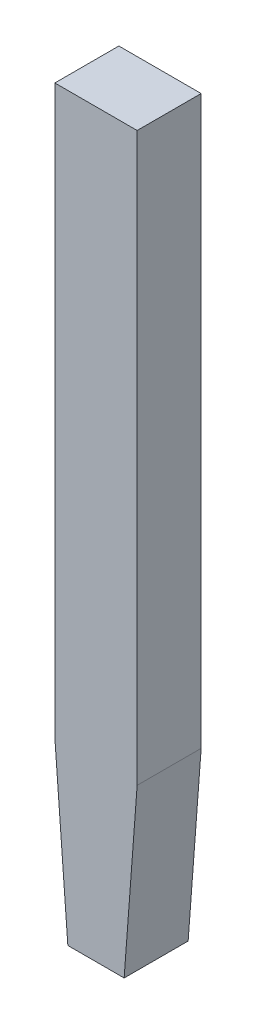
ISO-10303-21;
HEADER;
FILE_DESCRIPTION(('STEP AP214'),'2;1');
FILE_NAME('part.step','',(''),(''),'','','');
FILE_SCHEMA(('AUTOMOTIVE_DESIGN { 1 0 10303 214 1 1 1 1 }'));
ENDSEC;
DATA;
#1=APPLICATION_CONTEXT('core data for automotive mechanical design processes');
#2=APPLICATION_PROTOCOL_DEFINITION('international standard','automotive_design',2000,#1);
#3=PRODUCT_CONTEXT('',#1,'mechanical');
#4=PRODUCT('Part','Part','',(#3));
#5=PRODUCT_RELATED_PRODUCT_CATEGORY('part','',(#4));
#6=PRODUCT_DEFINITION_FORMATION('','',#4);
#7=PRODUCT_DEFINITION_CONTEXT('part definition',#1,'design');
#8=PRODUCT_DEFINITION('design','',#6,#7);
#9=PRODUCT_DEFINITION_SHAPE('','',#8);
#10=(LENGTH_UNIT() NAMED_UNIT(*) SI_UNIT(.MILLI.,.METRE.));
#11=(NAMED_UNIT(*) PLANE_ANGLE_UNIT() SI_UNIT($,.RADIAN.));
#12=(NAMED_UNIT(*) SI_UNIT($,.STERADIAN.) SOLID_ANGLE_UNIT());
#13=UNCERTAINTY_MEASURE_WITH_UNIT(LENGTH_MEASURE(1.E-05),#10,'distance_accuracy_value','');
#14=(GEOMETRIC_REPRESENTATION_CONTEXT(3) GLOBAL_UNCERTAINTY_ASSIGNED_CONTEXT((#13)) GLOBAL_UNIT_ASSIGNED_CONTEXT((#10,
#11,#12)) REPRESENTATION_CONTEXT('',''));
#15=CARTESIAN_POINT('',(0.,0.,0.));
#16=DIRECTION('',(0.,0.,1.));
#17=DIRECTION('',(1.,0.,0.));
#18=AXIS2_PLACEMENT_3D('',#15,#16,#17);
#19=CARTESIAN_POINT('',(47.87457889831,1.696835055312,3.705000000046));
#20=DIRECTION('',(0.,0.,1.));
#21=DIRECTION('',(1.,0.,0.));
#22=AXIS2_PLACEMENT_3D('',#19,#20,#21);
#23=PLANE('',#22);
#24=DIRECTION('',(1.,0.,0.));
#25=VECTOR('',#24,1.);
#26=CARTESIAN_POINT('',(38.93957889831,-15.17126218978,3.705000000046));
#27=LINE('',#26,#25);
#28=CARTESIAN_POINT('',(49.4406861916904,-15.17126218978,3.705000000046));
#29=VERTEX_POINT('',#28);
#30=CARTESIAN_POINT('',(49.7484716049296,-15.17126218978,3.705000000046));
#31=VERTEX_POINT('',#30);
#32=EDGE_CURVE('E94',#29,#31,#27,.T.);
#33=ORIENTED_EDGE('',*,*,#32,.T.);
#34=DIRECTION('',(0.0747899482416168,0.997199309888458,0.));
#35=VECTOR('',#34,1.);
#36=CARTESIAN_POINT('',(49.81957889831,-14.22316494469,3.705000000046));
#37=LINE('',#36,#35);
#38=CARTESIAN_POINT('',(49.81957889831,-14.2231649446899,3.705000000046));
#39=VERTEX_POINT('',#38);
#40=EDGE_CURVE('E98',#39,#31,#37,.F.);
#41=ORIENTED_EDGE('',*,*,#40,.F.);
#42=DIRECTION('',(0.,1.,0.));
#43=VECTOR('',#42,1.);
#44=CARTESIAN_POINT('',(49.81957889831,-10.46816494469,3.705000000046));
#45=LINE('',#44,#43);
#46=CARTESIAN_POINT('',(49.81957889831,-11.12202888849,3.705000000046));
#47=VERTEX_POINT('',#46);
#48=EDGE_CURVE('E83',#47,#39,#45,.F.);
#49=ORIENTED_EDGE('',*,*,#48,.F.);
#50=DIRECTION('',(1.,0.,0.));
#51=VECTOR('',#50,1.);
#52=CARTESIAN_POINT('',(44.47457889831,-11.12202888849,3.705000000046));
#53=LINE('',#52,#51);
#54=CARTESIAN_POINT('',(49.36957889831,-11.12202888849,3.705000000046));
#55=VERTEX_POINT('',#54);
#56=EDGE_CURVE('E20',#47,#55,#53,.F.);
#57=ORIENTED_EDGE('',*,*,#56,.T.);
#58=DIRECTION('',(0.,1.,0.));
#59=VECTOR('',#58,1.);
#60=CARTESIAN_POINT('',(49.36957889831,-10.46816494469,3.705000000046));
#61=LINE('',#60,#59);
#62=CARTESIAN_POINT('',(49.36957889831,-14.2231649446902,3.705000000046));
#63=VERTEX_POINT('',#62);
#64=EDGE_CURVE('E71',#63,#55,#61,.T.);
#65=ORIENTED_EDGE('',*,*,#64,.F.);
#66=DIRECTION('',(0.0747899482416168,-0.997199309888458,0.));
#67=VECTOR('',#66,1.);
#68=CARTESIAN_POINT('',(49.36957889831,-14.22316494469,3.705000000046));
#69=LINE('',#68,#67);
#70=EDGE_CURVE('E66',#29,#63,#69,.F.);
#71=ORIENTED_EDGE('',*,*,#70,.F.);
#72=EDGE_LOOP('',(#33,#41,#49,#57,#65,#71));
#73=FACE_BOUND('',#72,.T.);
#74=ADVANCED_FACE('F17',(#73),#23,.T.);
#75=CARTESIAN_POINT('',(44.47457889831,-11.12202888849,-0.158278306686));
#76=DIRECTION('',(0.,-1.,0.));
#77=DIRECTION('',(0.,0.,-1.));
#78=AXIS2_PLACEMENT_3D('',#75,#76,#77);
#79=PLANE('',#78);
#80=DIRECTION('',(1.,0.,0.));
#81=VECTOR('',#80,1.);
#82=CARTESIAN_POINT('',(47.87457889831,-11.12202888849,3.355000000046));
#83=LINE('',#82,#81);
#84=CARTESIAN_POINT('',(49.81957889831,-11.12202888849,3.355000000046));
#85=VERTEX_POINT('',#84);
#86=CARTESIAN_POINT('',(49.36957889831,-11.12202888849,3.355000000046));
#87=VERTEX_POINT('',#86);
#88=EDGE_CURVE('E89',#85,#87,#83,.F.);
#89=ORIENTED_EDGE('',*,*,#88,.T.);
#90=DIRECTION('',(0.,0.,1.));
#91=VECTOR('',#90,1.);
#92=CARTESIAN_POINT('',(49.36957889831,-11.12202888849,3.355000000046));
#93=LINE('',#92,#91);
#94=EDGE_CURVE('E76',#55,#87,#93,.F.);
#95=ORIENTED_EDGE('',*,*,#94,.F.);
#96=ORIENTED_EDGE('',*,*,#56,.F.);
#97=DIRECTION('',(0.,0.,-1.));
#98=VECTOR('',#97,1.);
#99=CARTESIAN_POINT('',(49.81957889831,-11.12202888849,3.355000000046));
#100=LINE('',#99,#98);
#101=EDGE_CURVE('E102',#85,#47,#100,.F.);
#102=ORIENTED_EDGE('',*,*,#101,.F.);
#103=EDGE_LOOP('',(#89,#95,#96,#102));
#104=FACE_BOUND('',#103,.T.);
#105=ADVANCED_FACE('F88',(#104),#79,.F.);
#106=CARTESIAN_POINT('',(49.36957889831,-10.46816494469,3.355000000046));
#107=DIRECTION('',(-1.,0.,0.));
#108=DIRECTION('',(0.,0.,1.));
#109=AXIS2_PLACEMENT_3D('',#106,#107,#108);
#110=PLANE('',#109);
#111=DIRECTION('',(0.,1.,0.));
#112=VECTOR('',#111,1.);
#113=CARTESIAN_POINT('',(49.36957889831,1.696835055312,3.355000000046));
#114=LINE('',#113,#112);
#115=CARTESIAN_POINT('',(49.36957889831,-14.2231649446901,3.355000000046));
#116=VERTEX_POINT('',#115);
#117=EDGE_CURVE('E107',#87,#116,#114,.F.);
#118=ORIENTED_EDGE('',*,*,#117,.T.);
#119=DIRECTION('',(0.,0.,1.));
#120=VECTOR('',#119,1.);
#121=CARTESIAN_POINT('',(49.36957889831,-14.22316494469,3.355000000046));
#122=LINE('',#121,#120);
#123=EDGE_CURVE('E78',#63,#116,#122,.F.);
#124=ORIENTED_EDGE('',*,*,#123,.F.);
#125=ORIENTED_EDGE('',*,*,#64,.T.);
#126=ORIENTED_EDGE('',*,*,#94,.T.);
#127=EDGE_LOOP('',(#118,#124,#125,#126));
#128=FACE_BOUND('',#127,.T.);
#129=ADVANCED_FACE('F74',(#128),#110,.T.);
#130=CARTESIAN_POINT('',(49.36957889831,-14.22316494469,3.355000000046));
#131=DIRECTION('',(-0.997199309888458,-0.0747899482416168,0.));
#132=DIRECTION('',(0.0747899482416168,-0.997199309888458,0.));
#133=AXIS2_PLACEMENT_3D('',#130,#131,#132);
#134=PLANE('',#133);
#135=ORIENTED_EDGE('',*,*,#70,.T.);
#136=ORIENTED_EDGE('',*,*,#123,.T.);
#137=DIRECTION('',(0.0747899482397982,-0.997199309888594,0.));
#138=VECTOR('',#137,1.);
#139=CARTESIAN_POINT('',(49.36957889831,-14.22316494469,3.355000000046));
#140=LINE('',#139,#138);
#141=CARTESIAN_POINT('',(49.4406861916909,-15.1712621897799,3.355000000046));
#142=VERTEX_POINT('',#141);
#143=EDGE_CURVE('E109',#116,#142,#140,.T.);
#144=ORIENTED_EDGE('',*,*,#143,.T.);
#145=DIRECTION('',(0.,0.,1.));
#146=VECTOR('',#145,1.);
#147=CARTESIAN_POINT('',(49.44068619169,-15.17126218978,-0.8137967800219));
#148=LINE('',#147,#146);
#149=EDGE_CURVE('E96',#142,#29,#148,.T.);
#150=ORIENTED_EDGE('',*,*,#149,.T.);
#151=EDGE_LOOP('',(#135,#136,#144,#150));
#152=FACE_BOUND('',#151,.T.);
#153=ADVANCED_FACE('F126',(#152),#134,.T.);
#154=CARTESIAN_POINT('',(38.93957889831,-15.17126218978,-0.8137967800219));
#155=DIRECTION('',(0.,1.,0.));
#156=DIRECTION('',(0.,0.,1.));
#157=AXIS2_PLACEMENT_3D('',#154,#155,#156);
#158=PLANE('',#157);
#159=DIRECTION('',(1.,0.,0.));
#160=VECTOR('',#159,1.);
#161=CARTESIAN_POINT('',(47.87457889831,-15.17126218978,3.355000000046));
#162=LINE('',#161,#160);
#163=CARTESIAN_POINT('',(49.7484716049296,-15.17126218978,3.355000000046));
#164=VERTEX_POINT('',#163);
#165=EDGE_CURVE('E112',#142,#164,#162,.T.);
#166=ORIENTED_EDGE('',*,*,#165,.T.);
#167=DIRECTION('',(0.,0.,1.));
#168=VECTOR('',#167,1.);
#169=CARTESIAN_POINT('',(49.7484716049283,-15.1712621897799,3.355000000046));
#170=LINE('',#169,#168);
#171=EDGE_CURVE('E100',#31,#164,#170,.F.);
#172=ORIENTED_EDGE('',*,*,#171,.F.);
#173=ORIENTED_EDGE('',*,*,#32,.F.);
#174=ORIENTED_EDGE('',*,*,#149,.F.);
#175=EDGE_LOOP('',(#166,#172,#173,#174));
#176=FACE_BOUND('',#175,.T.);
#177=ADVANCED_FACE('F125',(#176),#158,.F.);
#178=CARTESIAN_POINT('',(49.81957889831,-14.22316494469,3.355000000046));
#179=DIRECTION('',(0.997199309888458,-0.0747899482416168,0.));
#180=DIRECTION('',(0.0747899482416168,0.997199309888458,0.));
#181=AXIS2_PLACEMENT_3D('',#178,#179,#180);
#182=PLANE('',#181);
#183=DIRECTION('',(0.0747899482397982,0.997199309888594,0.));
#184=VECTOR('',#183,1.);
#185=CARTESIAN_POINT('',(49.74847160493,-15.17126218978,3.355000000046));
#186=LINE('',#185,#184);
#187=CARTESIAN_POINT('',(49.81957889831,-14.22316494469,3.355000000046));
#188=VERTEX_POINT('',#187);
#189=EDGE_CURVE('E26',#164,#188,#186,.T.);
#190=ORIENTED_EDGE('',*,*,#189,.T.);
#191=DIRECTION('',(0.,0.,-1.));
#192=VECTOR('',#191,1.);
#193=CARTESIAN_POINT('',(49.81957889831,-14.22316494469,3.355000000046));
#194=LINE('',#193,#192);
#195=EDGE_CURVE('E34',#39,#188,#194,.T.);
#196=ORIENTED_EDGE('',*,*,#195,.F.);
#197=ORIENTED_EDGE('',*,*,#40,.T.);
#198=ORIENTED_EDGE('',*,*,#171,.T.);
#199=EDGE_LOOP('',(#190,#196,#197,#198));
#200=FACE_BOUND('',#199,.T.);
#201=ADVANCED_FACE('F118',(#200),#182,.T.);
#202=CARTESIAN_POINT('',(49.81957889831,-10.46816494469,3.355000000046));
#203=DIRECTION('',(1.,0.,0.));
#204=DIRECTION('',(0.,0.,-1.));
#205=AXIS2_PLACEMENT_3D('',#202,#203,#204);
#206=PLANE('',#205);
#207=ORIENTED_EDGE('',*,*,#48,.T.);
#208=ORIENTED_EDGE('',*,*,#195,.T.);
#209=DIRECTION('',(0.,1.,0.));
#210=VECTOR('',#209,1.);
#211=CARTESIAN_POINT('',(49.81957889831,1.696835055312,3.355000000046));
#212=LINE('',#211,#210);
#213=EDGE_CURVE('E11',#188,#85,#212,.T.);
#214=ORIENTED_EDGE('',*,*,#213,.T.);
#215=ORIENTED_EDGE('',*,*,#101,.T.);
#216=EDGE_LOOP('',(#207,#208,#214,#215));
#217=FACE_BOUND('',#216,.T.);
#218=ADVANCED_FACE('F127',(#217),#206,.T.);
#219=CARTESIAN_POINT('',(47.87457889831,1.696835055312,3.355000000046));
#220=DIRECTION('',(0.,0.,1.));
#221=DIRECTION('',(1.,0.,0.));
#222=AXIS2_PLACEMENT_3D('',#219,#220,#221);
#223=PLANE('',#222);
#224=ORIENTED_EDGE('',*,*,#189,.F.);
#225=ORIENTED_EDGE('',*,*,#165,.F.);
#226=ORIENTED_EDGE('',*,*,#143,.F.);
#227=ORIENTED_EDGE('',*,*,#117,.F.);
#228=ORIENTED_EDGE('',*,*,#88,.F.);
#229=ORIENTED_EDGE('',*,*,#213,.F.);
#230=EDGE_LOOP('',(#224,#225,#226,#227,#228,#229));
#231=FACE_BOUND('',#230,.T.);
#232=ADVANCED_FACE('F122',(#231),#223,.F.);
#233=CLOSED_SHELL('',(#74,#105,#129,#153,#177,#201,#218,#232));
#234=MANIFOLD_SOLID_BREP('B1',#233);
#235=ADVANCED_BREP_SHAPE_REPRESENTATION('',(#18,#234),#14);
#236=SHAPE_DEFINITION_REPRESENTATION(#9,#235);
ENDSEC;
END-ISO-10303-21;
